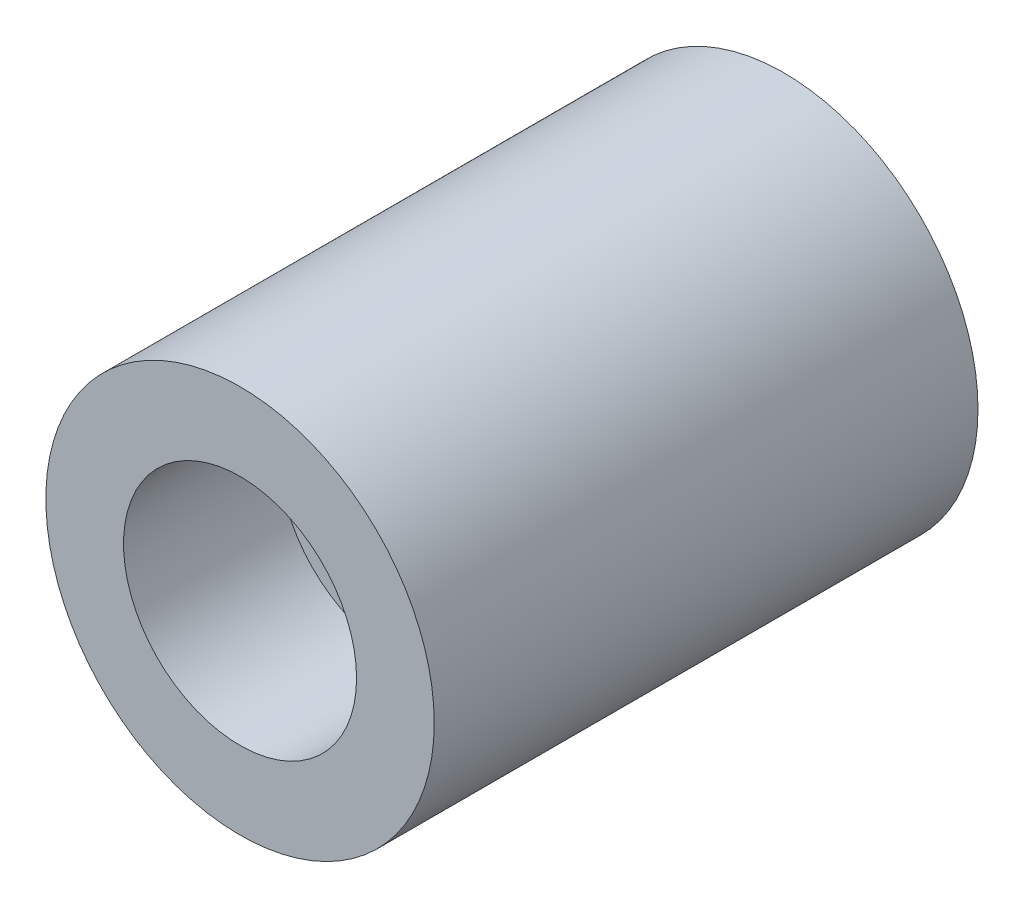
ISO-10303-21;
HEADER;
FILE_DESCRIPTION(('STEP AP214'),'2;1');
FILE_NAME('part.step','',(''),(''),'','','');
FILE_SCHEMA(('AUTOMOTIVE_DESIGN { 1 0 10303 214 1 1 1 1 }'));
ENDSEC;
DATA;
#1=APPLICATION_CONTEXT('core data for automotive mechanical design processes');
#2=APPLICATION_PROTOCOL_DEFINITION('international standard','automotive_design',2000,#1);
#3=PRODUCT_CONTEXT('',#1,'mechanical');
#4=PRODUCT('Part','Part','',(#3));
#5=PRODUCT_RELATED_PRODUCT_CATEGORY('part','',(#4));
#6=PRODUCT_DEFINITION_FORMATION('','',#4);
#7=PRODUCT_DEFINITION_CONTEXT('part definition',#1,'design');
#8=PRODUCT_DEFINITION('design','',#6,#7);
#9=PRODUCT_DEFINITION_SHAPE('','',#8);
#10=(LENGTH_UNIT() NAMED_UNIT(*) SI_UNIT(.MILLI.,.METRE.));
#11=(NAMED_UNIT(*) PLANE_ANGLE_UNIT() SI_UNIT($,.RADIAN.));
#12=(NAMED_UNIT(*) SI_UNIT($,.STERADIAN.) SOLID_ANGLE_UNIT());
#13=UNCERTAINTY_MEASURE_WITH_UNIT(LENGTH_MEASURE(1.E-05),#10,'distance_accuracy_value','');
#14=(GEOMETRIC_REPRESENTATION_CONTEXT(3) GLOBAL_UNCERTAINTY_ASSIGNED_CONTEXT((#13)) GLOBAL_UNIT_ASSIGNED_CONTEXT((#10,
#11,#12)) REPRESENTATION_CONTEXT('',''));
#15=CARTESIAN_POINT('',(0.,0.,0.));
#16=DIRECTION('',(0.,0.,1.));
#17=DIRECTION('',(1.,0.,0.));
#18=AXIS2_PLACEMENT_3D('',#15,#16,#17);
#19=CARTESIAN_POINT('',(0.,0.,140.));
#20=DIRECTION('',(0.,0.,-1.));
#21=DIRECTION('',(-1.,0.,0.));
#22=AXIS2_PLACEMENT_3D('',#19,#20,#21);
#23=CYLINDRICAL_SURFACE('',#22,50.);
#24=CARTESIAN_POINT('',(0.,0.,140.));
#25=DIRECTION('',(0.,0.,1.));
#26=DIRECTION('',(1.,0.,0.));
#27=AXIS2_PLACEMENT_3D('',#24,#25,#26);
#28=CIRCLE('',#27,50.);
#29=CARTESIAN_POINT('',(50.,0.,140.));
#30=VERTEX_POINT('',#29);
#31=EDGE_CURVE('E10',#30,#30,#28,.T.);
#32=ORIENTED_EDGE('',*,*,#31,.F.);
#33=EDGE_LOOP('',(#32));
#34=FACE_BOUND('',#33,.T.);
#35=CARTESIAN_POINT('',(0.,0.,0.));
#36=DIRECTION('',(0.,0.,1.));
#37=DIRECTION('',(1.,0.,0.));
#38=AXIS2_PLACEMENT_3D('',#35,#36,#37);
#39=CIRCLE('',#38,50.);
#40=CARTESIAN_POINT('',(50.,0.,0.));
#41=VERTEX_POINT('',#40);
#42=EDGE_CURVE('E38',#41,#41,#39,.T.);
#43=ORIENTED_EDGE('',*,*,#42,.T.);
#44=EDGE_LOOP('',(#43));
#45=FACE_BOUND('',#44,.T.);
#46=ADVANCED_FACE('F31',(#34,#45),#23,.T.);
#47=CARTESIAN_POINT('',(0.,0.,140.));
#48=DIRECTION('',(0.,0.,1.));
#49=DIRECTION('',(1.,0.,0.));
#50=AXIS2_PLACEMENT_3D('',#47,#48,#49);
#51=PLANE('',#50);
#52=CARTESIAN_POINT('',(0.,0.,140.));
#53=DIRECTION('',(0.,0.,1.));
#54=DIRECTION('',(1.,0.,0.));
#55=AXIS2_PLACEMENT_3D('',#52,#53,#54);
#56=CIRCLE('',#55,30.);
#57=CARTESIAN_POINT('',(30.,0.,140.));
#58=VERTEX_POINT('',#57);
#59=EDGE_CURVE('E47',#58,#58,#56,.T.);
#60=ORIENTED_EDGE('',*,*,#59,.F.);
#61=EDGE_LOOP('',(#60));
#62=FACE_BOUND('',#61,.T.);
#63=ORIENTED_EDGE('',*,*,#31,.T.);
#64=EDGE_LOOP('',(#63));
#65=FACE_BOUND('',#64,.T.);
#66=ADVANCED_FACE('F73',(#62,#65),#51,.T.);
#67=CARTESIAN_POINT('',(0.,0.,0.));
#68=DIRECTION('',(0.,0.,1.));
#69=DIRECTION('',(1.,0.,0.));
#70=AXIS2_PLACEMENT_3D('',#67,#68,#69);
#71=PLANE('',#70);
#72=ORIENTED_EDGE('',*,*,#42,.F.);
#73=EDGE_LOOP('',(#72));
#74=FACE_BOUND('',#73,.T.);
#75=ADVANCED_FACE('F78',(#74),#71,.F.);
#76=CARTESIAN_POINT('',(0.,0.,100.));
#77=DIRECTION('',(0.,0.,1.));
#78=DIRECTION('',(1.,0.,0.));
#79=AXIS2_PLACEMENT_3D('',#76,#77,#78);
#80=PLANE('',#79);
#81=CARTESIAN_POINT('',(0.,0.,100.));
#82=DIRECTION('',(0.,0.,1.));
#83=DIRECTION('',(1.,0.,0.));
#84=AXIS2_PLACEMENT_3D('',#81,#82,#83);
#85=CIRCLE('',#84,30.);
#86=CARTESIAN_POINT('',(30.,0.,100.));
#87=VERTEX_POINT('',#86);
#88=EDGE_CURVE('E50',#87,#87,#85,.T.);
#89=ORIENTED_EDGE('',*,*,#88,.T.);
#90=EDGE_LOOP('',(#89));
#91=FACE_BOUND('',#90,.T.);
#92=CARTESIAN_POINT('',(0.,0.,100.));
#93=DIRECTION('',(0.,0.,1.));
#94=DIRECTION('',(1.,0.,0.));
#95=AXIS2_PLACEMENT_3D('',#92,#93,#94);
#96=CIRCLE('',#95,10.);
#97=CARTESIAN_POINT('',(10.,0.,100.));
#98=VERTEX_POINT('',#97);
#99=EDGE_CURVE('E34',#98,#98,#96,.F.);
#100=ORIENTED_EDGE('',*,*,#99,.T.);
#101=EDGE_LOOP('',(#100));
#102=FACE_BOUND('',#101,.T.);
#103=ADVANCED_FACE('F57',(#91,#102),#80,.T.);
#104=CARTESIAN_POINT('',(0.,0.,100.));
#105=DIRECTION('',(0.,0.,1.));
#106=DIRECTION('',(1.,0.,0.));
#107=AXIS2_PLACEMENT_3D('',#104,#105,#106);
#108=CYLINDRICAL_SURFACE('',#107,30.);
#109=ORIENTED_EDGE('',*,*,#88,.F.);
#110=EDGE_LOOP('',(#109));
#111=FACE_BOUND('',#110,.T.);
#112=ORIENTED_EDGE('',*,*,#59,.T.);
#113=EDGE_LOOP('',(#112));
#114=FACE_BOUND('',#113,.T.);
#115=ADVANCED_FACE('F67',(#111,#114),#108,.F.);
#116=CARTESIAN_POINT('',(0.,0.,20.));
#117=DIRECTION('',(0.,0.,1.));
#118=DIRECTION('',(1.,0.,0.));
#119=AXIS2_PLACEMENT_3D('',#116,#117,#118);
#120=PLANE('',#119);
#121=CARTESIAN_POINT('',(0.,0.,20.));
#122=DIRECTION('',(0.,0.,1.));
#123=DIRECTION('',(1.,0.,0.));
#124=AXIS2_PLACEMENT_3D('',#121,#122,#123);
#125=CIRCLE('',#124,10.);
#126=CARTESIAN_POINT('',(10.,0.,20.));
#127=VERTEX_POINT('',#126);
#128=EDGE_CURVE('E43',#127,#127,#125,.T.);
#129=ORIENTED_EDGE('',*,*,#128,.T.);
#130=EDGE_LOOP('',(#129));
#131=FACE_BOUND('',#130,.T.);
#132=ADVANCED_FACE('F61',(#131),#120,.T.);
#133=CARTESIAN_POINT('',(0.,0.,20.));
#134=DIRECTION('',(0.,0.,1.));
#135=DIRECTION('',(1.,0.,0.));
#136=AXIS2_PLACEMENT_3D('',#133,#134,#135);
#137=CYLINDRICAL_SURFACE('',#136,10.);
#138=ORIENTED_EDGE('',*,*,#128,.F.);
#139=EDGE_LOOP('',(#138));
#140=FACE_BOUND('',#139,.T.);
#141=ORIENTED_EDGE('',*,*,#99,.F.);
#142=EDGE_LOOP('',(#141));
#143=FACE_BOUND('',#142,.T.);
#144=ADVANCED_FACE('F59',(#140,#143),#137,.F.);
#145=CLOSED_SHELL('',(#46,#66,#75,#103,#115,#132,#144));
#146=MANIFOLD_SOLID_BREP('B2',#145);
#147=ADVANCED_BREP_SHAPE_REPRESENTATION('',(#18,#146),#14);
#148=SHAPE_DEFINITION_REPRESENTATION(#9,#147);
ENDSEC;
END-ISO-10303-21;
